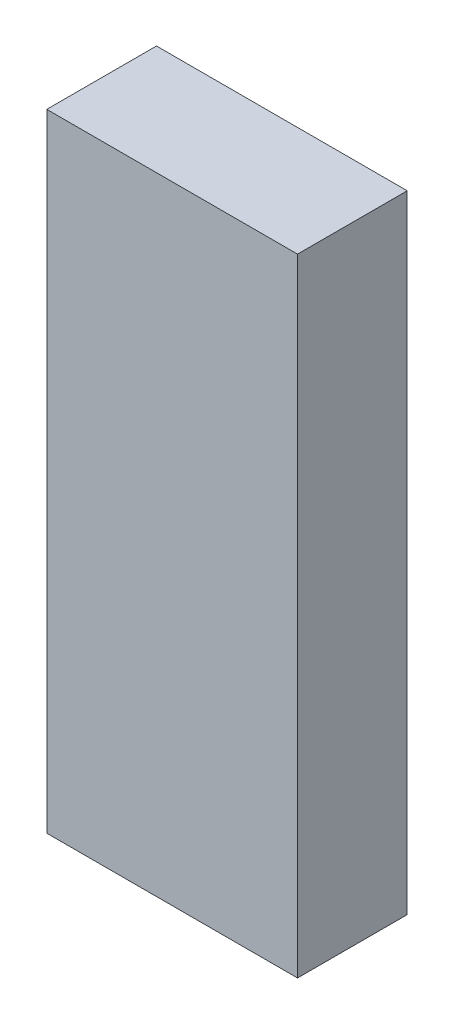
ISO-10303-21;
HEADER;
FILE_DESCRIPTION(('STEP AP214'),'2;1');
FILE_NAME('part.step','',(''),(''),'','','');
FILE_SCHEMA(('AUTOMOTIVE_DESIGN { 1 0 10303 214 1 1 1 1 }'));
ENDSEC;
DATA;
#1=APPLICATION_CONTEXT('core data for automotive mechanical design processes');
#2=APPLICATION_PROTOCOL_DEFINITION('international standard','automotive_design',2000,#1);
#3=PRODUCT_CONTEXT('',#1,'mechanical');
#4=PRODUCT('Part','Part','',(#3));
#5=PRODUCT_RELATED_PRODUCT_CATEGORY('part','',(#4));
#6=PRODUCT_DEFINITION_FORMATION('','',#4);
#7=PRODUCT_DEFINITION_CONTEXT('part definition',#1,'design');
#8=PRODUCT_DEFINITION('design','',#6,#7);
#9=PRODUCT_DEFINITION_SHAPE('','',#8);
#10=(LENGTH_UNIT() NAMED_UNIT(*) SI_UNIT(.MILLI.,.METRE.));
#11=(NAMED_UNIT(*) PLANE_ANGLE_UNIT() SI_UNIT($,.RADIAN.));
#12=(NAMED_UNIT(*) SI_UNIT($,.STERADIAN.) SOLID_ANGLE_UNIT());
#13=UNCERTAINTY_MEASURE_WITH_UNIT(LENGTH_MEASURE(1.E-05),#10,'distance_accuracy_value','');
#14=(GEOMETRIC_REPRESENTATION_CONTEXT(3) GLOBAL_UNCERTAINTY_ASSIGNED_CONTEXT((#13)) GLOBAL_UNIT_ASSIGNED_CONTEXT((#10,
#11,#12)) REPRESENTATION_CONTEXT('',''));
#15=CARTESIAN_POINT('',(0.,0.,0.));
#16=DIRECTION('',(0.,0.,1.));
#17=DIRECTION('',(1.,0.,0.));
#18=AXIS2_PLACEMENT_3D('',#15,#16,#17);
#19=CARTESIAN_POINT('',(2.00000108,5.00000016,1.74999904));
#20=DIRECTION('',(0.,0.,-1.));
#21=DIRECTION('',(-1.,0.,0.));
#22=AXIS2_PLACEMENT_3D('',#19,#20,#21);
#23=PLANE('',#22);
#24=DIRECTION('',(0.,1.,0.));
#25=VECTOR('',#24,1.);
#26=CARTESIAN_POINT('',(-2.00000108,5.00000016,1.74999904));
#27=LINE('',#26,#25);
#28=CARTESIAN_POINT('',(-2.00000108,5.00000016,1.74999904));
#29=VERTEX_POINT('',#28);
#30=CARTESIAN_POINT('',(-2.00000108,-5.00000016,1.74999904));
#31=VERTEX_POINT('',#30);
#32=EDGE_CURVE('E55',#29,#31,#27,.F.);
#33=ORIENTED_EDGE('',*,*,#32,.T.);
#34=DIRECTION('',(1.,0.,0.));
#35=VECTOR('',#34,1.);
#36=CARTESIAN_POINT('',(-2.00000108,-5.00000016,1.74999904));
#37=LINE('',#36,#35);
#38=CARTESIAN_POINT('',(2.00000108,-5.00000016,1.74999904));
#39=VERTEX_POINT('',#38);
#40=EDGE_CURVE('E57',#31,#39,#37,.T.);
#41=ORIENTED_EDGE('',*,*,#40,.T.);
#42=DIRECTION('',(0.,1.,0.));
#43=VECTOR('',#42,1.);
#44=CARTESIAN_POINT('',(2.00000108,-5.00000016,1.74999904));
#45=LINE('',#44,#43);
#46=CARTESIAN_POINT('',(2.00000108,5.00000016,1.74999904));
#47=VERTEX_POINT('',#46);
#48=EDGE_CURVE('E20',#39,#47,#45,.T.);
#49=ORIENTED_EDGE('',*,*,#48,.T.);
#50=DIRECTION('',(1.,0.,0.));
#51=VECTOR('',#50,1.);
#52=CARTESIAN_POINT('',(2.00000108,5.00000016,1.74999904));
#53=LINE('',#52,#51);
#54=EDGE_CURVE('E80',#47,#29,#53,.F.);
#55=ORIENTED_EDGE('',*,*,#54,.T.);
#56=EDGE_LOOP('',(#33,#41,#49,#55));
#57=FACE_BOUND('',#56,.T.);
#58=ADVANCED_FACE('F17',(#57),#23,.F.);
#59=CARTESIAN_POINT('',(2.00000108,-5.00000016,0.));
#60=DIRECTION('',(-1.,0.,0.));
#61=DIRECTION('',(0.,0.,1.));
#62=AXIS2_PLACEMENT_3D('',#59,#60,#61);
#63=PLANE('',#62);
#64=DIRECTION('',(0.,0.,-1.));
#65=VECTOR('',#64,1.);
#66=CARTESIAN_POINT('',(2.00000108,5.00000016,0.));
#67=LINE('',#66,#65);
#68=CARTESIAN_POINT('',(2.00000108,5.00000016,0.));
#69=VERTEX_POINT('',#68);
#70=EDGE_CURVE('E68',#69,#47,#67,.F.);
#71=ORIENTED_EDGE('',*,*,#70,.T.);
#72=ORIENTED_EDGE('',*,*,#48,.F.);
#73=DIRECTION('',(0.,0.,1.));
#74=VECTOR('',#73,1.);
#75=CARTESIAN_POINT('',(2.00000108,-5.00000016,0.));
#76=LINE('',#75,#74);
#77=CARTESIAN_POINT('',(2.00000108,-5.00000016,0.));
#78=VERTEX_POINT('',#77);
#79=EDGE_CURVE('E63',#39,#78,#76,.F.);
#80=ORIENTED_EDGE('',*,*,#79,.T.);
#81=DIRECTION('',(0.,1.,0.));
#82=VECTOR('',#81,1.);
#83=CARTESIAN_POINT('',(2.00000108,5.00000016,0.));
#84=LINE('',#83,#82);
#85=EDGE_CURVE('E83',#69,#78,#84,.F.);
#86=ORIENTED_EDGE('',*,*,#85,.F.);
#87=EDGE_LOOP('',(#71,#72,#80,#86));
#88=FACE_BOUND('',#87,.T.);
#89=ADVANCED_FACE('F65',(#88),#63,.F.);
#90=CARTESIAN_POINT('',(-2.00000108,-5.00000016,0.));
#91=DIRECTION('',(0.,1.,0.));
#92=DIRECTION('',(0.,0.,1.));
#93=AXIS2_PLACEMENT_3D('',#90,#91,#92);
#94=PLANE('',#93);
#95=ORIENTED_EDGE('',*,*,#79,.F.);
#96=ORIENTED_EDGE('',*,*,#40,.F.);
#97=DIRECTION('',(0.,0.,-1.));
#98=VECTOR('',#97,1.);
#99=CARTESIAN_POINT('',(-2.00000108,-5.00000016,0.));
#100=LINE('',#99,#98);
#101=CARTESIAN_POINT('',(-2.00000108,-5.00000016,0.));
#102=VERTEX_POINT('',#101);
#103=EDGE_CURVE('E75',#31,#102,#100,.T.);
#104=ORIENTED_EDGE('',*,*,#103,.T.);
#105=DIRECTION('',(-1.,0.,0.));
#106=VECTOR('',#105,1.);
#107=CARTESIAN_POINT('',(2.00000108,-5.00000016,0.));
#108=LINE('',#107,#106);
#109=EDGE_CURVE('E72',#78,#102,#108,.T.);
#110=ORIENTED_EDGE('',*,*,#109,.F.);
#111=EDGE_LOOP('',(#95,#96,#104,#110));
#112=FACE_BOUND('',#111,.T.);
#113=ADVANCED_FACE('F70',(#112),#94,.F.);
#114=CARTESIAN_POINT('',(-2.00000108,5.00000016,0.));
#115=DIRECTION('',(1.,0.,0.));
#116=DIRECTION('',(0.,0.,-1.));
#117=AXIS2_PLACEMENT_3D('',#114,#115,#116);
#118=PLANE('',#117);
#119=ORIENTED_EDGE('',*,*,#103,.F.);
#120=ORIENTED_EDGE('',*,*,#32,.F.);
#121=DIRECTION('',(0.,0.,-1.));
#122=VECTOR('',#121,1.);
#123=CARTESIAN_POINT('',(-2.00000108,5.00000016,0.));
#124=LINE('',#123,#122);
#125=CARTESIAN_POINT('',(-2.00000108,5.00000016,0.));
#126=VERTEX_POINT('',#125);
#127=EDGE_CURVE('E35',#29,#126,#124,.T.);
#128=ORIENTED_EDGE('',*,*,#127,.T.);
#129=DIRECTION('',(0.,1.,0.));
#130=VECTOR('',#129,1.);
#131=CARTESIAN_POINT('',(-2.00000108,5.00000016,0.));
#132=LINE('',#131,#130);
#133=EDGE_CURVE('E26',#102,#126,#132,.T.);
#134=ORIENTED_EDGE('',*,*,#133,.F.);
#135=EDGE_LOOP('',(#119,#120,#128,#134));
#136=FACE_BOUND('',#135,.T.);
#137=ADVANCED_FACE('F89',(#136),#118,.F.);
#138=CARTESIAN_POINT('',(2.00000108,5.00000016,0.));
#139=DIRECTION('',(0.,-1.,0.));
#140=DIRECTION('',(0.,0.,-1.));
#141=AXIS2_PLACEMENT_3D('',#138,#139,#140);
#142=PLANE('',#141);
#143=ORIENTED_EDGE('',*,*,#127,.F.);
#144=ORIENTED_EDGE('',*,*,#54,.F.);
#145=ORIENTED_EDGE('',*,*,#70,.F.);
#146=DIRECTION('',(-1.,0.,0.));
#147=VECTOR('',#146,1.);
#148=CARTESIAN_POINT('',(2.00000108,5.00000016,0.));
#149=LINE('',#148,#147);
#150=EDGE_CURVE('E11',#126,#69,#149,.F.);
#151=ORIENTED_EDGE('',*,*,#150,.F.);
#152=EDGE_LOOP('',(#143,#144,#145,#151));
#153=FACE_BOUND('',#152,.T.);
#154=ADVANCED_FACE('F91',(#153),#142,.F.);
#155=CARTESIAN_POINT('',(2.00000108,5.00000016,0.));
#156=DIRECTION('',(0.,0.,-1.));
#157=DIRECTION('',(-1.,0.,0.));
#158=AXIS2_PLACEMENT_3D('',#155,#156,#157);
#159=PLANE('',#158);
#160=ORIENTED_EDGE('',*,*,#133,.T.);
#161=ORIENTED_EDGE('',*,*,#150,.T.);
#162=ORIENTED_EDGE('',*,*,#85,.T.);
#163=ORIENTED_EDGE('',*,*,#109,.T.);
#164=EDGE_LOOP('',(#160,#161,#162,#163));
#165=FACE_BOUND('',#164,.T.);
#166=ADVANCED_FACE('F88',(#165),#159,.T.);
#167=CLOSED_SHELL('',(#58,#89,#113,#137,#154,#166));
#168=MANIFOLD_SOLID_BREP('B1',#167);
#169=ADVANCED_BREP_SHAPE_REPRESENTATION('',(#18,#168),#14);
#170=SHAPE_DEFINITION_REPRESENTATION(#9,#169);
ENDSEC;
END-ISO-10303-21;
